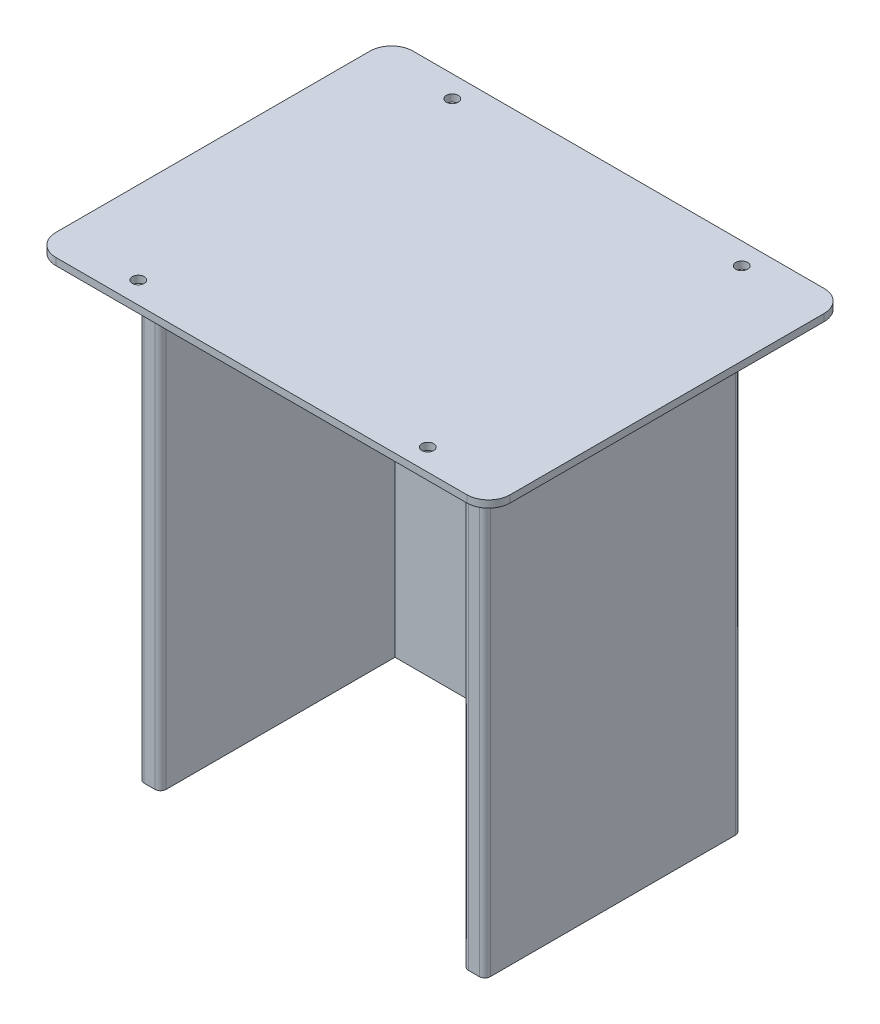
ISO-10303-21;
HEADER;
FILE_DESCRIPTION(('STEP AP214'),'2;1');
FILE_NAME('part.step','',(''),(''),'','','');
FILE_SCHEMA(('AUTOMOTIVE_DESIGN { 1 0 10303 214 1 1 1 1 }'));
ENDSEC;
DATA;
#1=APPLICATION_CONTEXT('core data for automotive mechanical design processes');
#2=APPLICATION_PROTOCOL_DEFINITION('international standard','automotive_design',2000,#1);
#3=PRODUCT_CONTEXT('',#1,'mechanical');
#4=PRODUCT('Part','Part','',(#3));
#5=PRODUCT_RELATED_PRODUCT_CATEGORY('part','',(#4));
#6=PRODUCT_DEFINITION_FORMATION('','',#4);
#7=PRODUCT_DEFINITION_CONTEXT('part definition',#1,'design');
#8=PRODUCT_DEFINITION('design','',#6,#7);
#9=PRODUCT_DEFINITION_SHAPE('','',#8);
#10=(LENGTH_UNIT() NAMED_UNIT(*) SI_UNIT(.MILLI.,.METRE.));
#11=(NAMED_UNIT(*) PLANE_ANGLE_UNIT() SI_UNIT($,.RADIAN.));
#12=(NAMED_UNIT(*) SI_UNIT($,.STERADIAN.) SOLID_ANGLE_UNIT());
#13=UNCERTAINTY_MEASURE_WITH_UNIT(LENGTH_MEASURE(1.E-05),#10,'distance_accuracy_value','');
#14=(GEOMETRIC_REPRESENTATION_CONTEXT(3) GLOBAL_UNCERTAINTY_ASSIGNED_CONTEXT((#13)) GLOBAL_UNIT_ASSIGNED_CONTEXT((#10,
#11,#12)) REPRESENTATION_CONTEXT('',''));
#15=CARTESIAN_POINT('',(0.,0.,0.));
#16=DIRECTION('',(0.,0.,1.));
#17=DIRECTION('',(1.,0.,0.));
#18=AXIS2_PLACEMENT_3D('',#15,#16,#17);
#19=CARTESIAN_POINT('',(110.010199778,3.302,82.55));
#20=DIRECTION('',(-1.,0.,0.));
#21=DIRECTION('',(0.,0.,1.));
#22=AXIS2_PLACEMENT_3D('',#19,#20,#21);
#23=PLANE('',#22);
#24=DIRECTION('',(0.,0.,-1.));
#25=VECTOR('',#24,1.);
#26=CARTESIAN_POINT('',(110.010199778,0.,82.55));
#27=LINE('',#26,#25);
#28=CARTESIAN_POINT('',(110.010199778,0.,72.55));
#29=VERTEX_POINT('',#28);
#30=CARTESIAN_POINT('',(110.010199778,0.,-72.55));
#31=VERTEX_POINT('',#30);
#32=EDGE_CURVE('E351',#29,#31,#27,.T.);
#33=ORIENTED_EDGE('',*,*,#32,.T.);
#34=DIRECTION('',(0.,-1.,0.));
#35=VECTOR('',#34,1.);
#36=CARTESIAN_POINT('',(110.010199778,3.302,-72.55));
#37=LINE('',#36,#35);
#38=CARTESIAN_POINT('',(110.010199778,3.302,-72.55));
#39=VERTEX_POINT('',#38);
#40=EDGE_CURVE('E425',#31,#39,#37,.F.);
#41=ORIENTED_EDGE('',*,*,#40,.T.);
#42=DIRECTION('',(0.,0.,-1.));
#43=VECTOR('',#42,1.);
#44=CARTESIAN_POINT('',(110.010199778,3.302,82.55));
#45=LINE('',#44,#43);
#46=CARTESIAN_POINT('',(110.010199778,3.302,72.55));
#47=VERTEX_POINT('',#46);
#48=EDGE_CURVE('E352',#47,#39,#45,.T.);
#49=ORIENTED_EDGE('',*,*,#48,.F.);
#50=DIRECTION('',(0.,-1.,0.));
#51=VECTOR('',#50,1.);
#52=CARTESIAN_POINT('',(110.010199778,3.302,72.55));
#53=LINE('',#52,#51);
#54=EDGE_CURVE('E421',#47,#29,#53,.T.);
#55=ORIENTED_EDGE('',*,*,#54,.T.);
#56=EDGE_LOOP('',(#33,#41,#49,#55));
#57=FACE_BOUND('',#56,.T.);
#58=ADVANCED_FACE('F41',(#57),#23,.F.);
#59=CARTESIAN_POINT('',(-99.934402,3.302,-82.55));
#60=DIRECTION('',(0.,0.,1.));
#61=DIRECTION('',(1.,0.,0.));
#62=AXIS2_PLACEMENT_3D('',#59,#60,#61);
#63=PLANE('',#62);
#64=DIRECTION('',(-1.,0.,0.));
#65=VECTOR('',#64,1.);
#66=CARTESIAN_POINT('',(-99.934402,0.,-82.55));
#67=LINE('',#66,#65);
#68=CARTESIAN_POINT('',(100.010199778,0.,-82.55));
#69=VERTEX_POINT('',#68);
#70=CARTESIAN_POINT('',(-89.934402,0.,-82.55));
#71=VERTEX_POINT('',#70);
#72=EDGE_CURVE('E373',#69,#71,#67,.T.);
#73=ORIENTED_EDGE('',*,*,#72,.T.);
#74=DIRECTION('',(0.,-1.,0.));
#75=VECTOR('',#74,1.);
#76=CARTESIAN_POINT('',(-89.934402,3.302,-82.55));
#77=LINE('',#76,#75);
#78=CARTESIAN_POINT('',(-89.934402,3.302,-82.55));
#79=VERTEX_POINT('',#78);
#80=EDGE_CURVE('E406',#71,#79,#77,.F.);
#81=ORIENTED_EDGE('',*,*,#80,.T.);
#82=DIRECTION('',(-1.,0.,0.));
#83=VECTOR('',#82,1.);
#84=CARTESIAN_POINT('',(-99.934402,3.302,-82.55));
#85=LINE('',#84,#83);
#86=CARTESIAN_POINT('',(100.010199778,3.302,-82.55));
#87=VERTEX_POINT('',#86);
#88=EDGE_CURVE('E356',#87,#79,#85,.T.);
#89=ORIENTED_EDGE('',*,*,#88,.F.);
#90=DIRECTION('',(0.,-1.,0.));
#91=VECTOR('',#90,1.);
#92=CARTESIAN_POINT('',(100.010199778,3.302,-82.55));
#93=LINE('',#92,#91);
#94=EDGE_CURVE('E402',#87,#69,#93,.T.);
#95=ORIENTED_EDGE('',*,*,#94,.T.);
#96=EDGE_LOOP('',(#73,#81,#89,#95));
#97=FACE_BOUND('',#96,.T.);
#98=ADVANCED_FACE('F585',(#97),#63,.F.);
#99=CARTESIAN_POINT('',(-99.934402,3.302,82.55));
#100=DIRECTION('',(1.,0.,0.));
#101=DIRECTION('',(0.,0.,-1.));
#102=AXIS2_PLACEMENT_3D('',#99,#100,#101);
#103=PLANE('',#102);
#104=DIRECTION('',(0.,0.,1.));
#105=VECTOR('',#104,1.);
#106=CARTESIAN_POINT('',(-99.934402,3.302,82.55));
#107=LINE('',#106,#105);
#108=CARTESIAN_POINT('',(-99.934402,3.302,-72.55));
#109=VERTEX_POINT('',#108);
#110=CARTESIAN_POINT('',(-99.934402,3.302,72.55));
#111=VERTEX_POINT('',#110);
#112=EDGE_CURVE('E361',#109,#111,#107,.T.);
#113=ORIENTED_EDGE('',*,*,#112,.F.);
#114=DIRECTION('',(0.,-1.,0.));
#115=VECTOR('',#114,1.);
#116=CARTESIAN_POINT('',(-99.934402,3.302,-72.55));
#117=LINE('',#116,#115);
#118=CARTESIAN_POINT('',(-99.934402,0.,-72.55));
#119=VERTEX_POINT('',#118);
#120=EDGE_CURVE('E386',#109,#119,#117,.T.);
#121=ORIENTED_EDGE('',*,*,#120,.T.);
#122=DIRECTION('',(0.,0.,1.));
#123=VECTOR('',#122,1.);
#124=CARTESIAN_POINT('',(-99.934402,0.,82.55));
#125=LINE('',#124,#123);
#126=CARTESIAN_POINT('',(-99.934402,0.,72.55));
#127=VERTEX_POINT('',#126);
#128=EDGE_CURVE('E377',#119,#127,#125,.T.);
#129=ORIENTED_EDGE('',*,*,#128,.T.);
#130=DIRECTION('',(0.,-1.,0.));
#131=VECTOR('',#130,1.);
#132=CARTESIAN_POINT('',(-99.934402,3.302,72.55));
#133=LINE('',#132,#131);
#134=EDGE_CURVE('E369',#127,#111,#133,.F.);
#135=ORIENTED_EDGE('',*,*,#134,.T.);
#136=EDGE_LOOP('',(#113,#121,#129,#135));
#137=FACE_BOUND('',#136,.T.);
#138=ADVANCED_FACE('F591',(#137),#103,.F.);
#139=CARTESIAN_POINT('',(-99.934402,3.302,82.55));
#140=DIRECTION('',(0.,0.,-1.));
#141=DIRECTION('',(-1.,0.,0.));
#142=AXIS2_PLACEMENT_3D('',#139,#140,#141);
#143=PLANE('',#142);
#144=DIRECTION('',(1.,0.,0.));
#145=VECTOR('',#144,1.);
#146=CARTESIAN_POINT('',(-99.934402,0.,82.55));
#147=LINE('',#146,#145);
#148=CARTESIAN_POINT('',(-89.934402,0.,82.55));
#149=VERTEX_POINT('',#148);
#150=CARTESIAN_POINT('',(100.010199778,0.,82.55));
#151=VERTEX_POINT('',#150);
#152=EDGE_CURVE('E357',#149,#151,#147,.T.);
#153=ORIENTED_EDGE('',*,*,#152,.T.);
#154=DIRECTION('',(0.,-1.,0.));
#155=VECTOR('',#154,1.);
#156=CARTESIAN_POINT('',(100.010199778,3.302,82.55));
#157=LINE('',#156,#155);
#158=CARTESIAN_POINT('',(100.010199778,3.302,82.55));
#159=VERTEX_POINT('',#158);
#160=EDGE_CURVE('E432',#151,#159,#157,.F.);
#161=ORIENTED_EDGE('',*,*,#160,.T.);
#162=DIRECTION('',(1.,0.,0.));
#163=VECTOR('',#162,1.);
#164=CARTESIAN_POINT('',(-99.934402,3.302,82.55));
#165=LINE('',#164,#163);
#166=CARTESIAN_POINT('',(-89.934402,3.302,82.55));
#167=VERTEX_POINT('',#166);
#168=EDGE_CURVE('E365',#167,#159,#165,.T.);
#169=ORIENTED_EDGE('',*,*,#168,.F.);
#170=DIRECTION('',(0.,-1.,0.));
#171=VECTOR('',#170,1.);
#172=CARTESIAN_POINT('',(-89.934402,3.302,82.55));
#173=LINE('',#172,#171);
#174=EDGE_CURVE('E428',#167,#149,#173,.T.);
#175=ORIENTED_EDGE('',*,*,#174,.T.);
#176=EDGE_LOOP('',(#153,#161,#169,#175));
#177=FACE_BOUND('',#176,.T.);
#178=ADVANCED_FACE('F853',(#177),#143,.F.);
#179=CARTESIAN_POINT('',(0.,3.302,0.));
#180=DIRECTION('',(0.,-1.,0.));
#181=DIRECTION('',(0.,0.,-1.));
#182=AXIS2_PLACEMENT_3D('',#179,#180,#181);
#183=PLANE('',#182);
#184=CARTESIAN_POINT('',(71.910199778,3.302,72.55));
#185=DIRECTION('',(0.,1.,0.));
#186=DIRECTION('',(0.,0.,1.));
#187=AXIS2_PLACEMENT_3D('',#184,#185,#186);
#188=CIRCLE('',#187,2.74999999999999);
#189=CARTESIAN_POINT('',(71.910199778,3.302,75.3));
#190=VERTEX_POINT('',#189);
#191=EDGE_CURVE('E319',#190,#190,#188,.T.);
#192=ORIENTED_EDGE('',*,*,#191,.F.);
#193=EDGE_LOOP('',(#192));
#194=FACE_BOUND('',#193,.T.);
#195=CARTESIAN_POINT('',(-61.834402,3.302,72.55));
#196=DIRECTION('',(0.,1.,0.));
#197=DIRECTION('',(0.,0.,1.));
#198=AXIS2_PLACEMENT_3D('',#195,#196,#197);
#199=CIRCLE('',#198,2.74999999999999);
#200=CARTESIAN_POINT('',(-61.834402,3.302,75.3));
#201=VERTEX_POINT('',#200);
#202=EDGE_CURVE('E327',#201,#201,#199,.T.);
#203=ORIENTED_EDGE('',*,*,#202,.F.);
#204=EDGE_LOOP('',(#203));
#205=FACE_BOUND('',#204,.T.);
#206=CARTESIAN_POINT('',(71.910199778,3.302,-72.55));
#207=DIRECTION('',(0.,1.,0.));
#208=DIRECTION('',(0.,0.,1.));
#209=AXIS2_PLACEMENT_3D('',#206,#207,#208);
#210=CIRCLE('',#209,2.74999999999999);
#211=CARTESIAN_POINT('',(71.910199778,3.302,-69.8));
#212=VERTEX_POINT('',#211);
#213=EDGE_CURVE('E335',#212,#212,#210,.T.);
#214=ORIENTED_EDGE('',*,*,#213,.F.);
#215=EDGE_LOOP('',(#214));
#216=FACE_BOUND('',#215,.T.);
#217=CARTESIAN_POINT('',(-61.834402,3.302,-72.55));
#218=DIRECTION('',(0.,1.,0.));
#219=DIRECTION('',(0.,0.,1.));
#220=AXIS2_PLACEMENT_3D('',#217,#218,#219);
#221=CIRCLE('',#220,2.74999999999999);
#222=CARTESIAN_POINT('',(-61.834402,3.302,-69.8));
#223=VERTEX_POINT('',#222);
#224=EDGE_CURVE('E343',#223,#223,#221,.T.);
#225=ORIENTED_EDGE('',*,*,#224,.F.);
#226=EDGE_LOOP('',(#225));
#227=FACE_BOUND('',#226,.T.);
#228=ORIENTED_EDGE('',*,*,#88,.T.);
#229=CARTESIAN_POINT('',(-89.934402,3.302,-72.55));
#230=DIRECTION('',(0.,-1.,0.));
#231=DIRECTION('',(0.,0.,-1.));
#232=AXIS2_PLACEMENT_3D('',#229,#230,#231);
#233=CIRCLE('',#232,10.);
#234=EDGE_CURVE('E418',#79,#109,#233,.F.);
#235=ORIENTED_EDGE('',*,*,#234,.T.);
#236=ORIENTED_EDGE('',*,*,#112,.T.);
#237=CARTESIAN_POINT('',(-89.934402,3.302,72.55));
#238=DIRECTION('',(0.,-1.,0.));
#239=DIRECTION('',(0.,0.,-1.));
#240=AXIS2_PLACEMENT_3D('',#237,#238,#239);
#241=CIRCLE('',#240,10.);
#242=EDGE_CURVE('E409',#111,#167,#241,.F.);
#243=ORIENTED_EDGE('',*,*,#242,.T.);
#244=ORIENTED_EDGE('',*,*,#168,.T.);
#245=CARTESIAN_POINT('',(100.010199778,3.302,72.55));
#246=DIRECTION('',(0.,-1.,0.));
#247=DIRECTION('',(0.,0.,-1.));
#248=AXIS2_PLACEMENT_3D('',#245,#246,#247);
#249=CIRCLE('',#248,10.);
#250=EDGE_CURVE('E412',#159,#47,#249,.F.);
#251=ORIENTED_EDGE('',*,*,#250,.T.);
#252=ORIENTED_EDGE('',*,*,#48,.T.);
#253=CARTESIAN_POINT('',(100.010199778,3.302,-72.55));
#254=DIRECTION('',(0.,-1.,0.));
#255=DIRECTION('',(0.,0.,-1.));
#256=AXIS2_PLACEMENT_3D('',#253,#254,#255);
#257=CIRCLE('',#256,10.);
#258=EDGE_CURVE('E415',#39,#87,#257,.F.);
#259=ORIENTED_EDGE('',*,*,#258,.T.);
#260=EDGE_LOOP('',(#228,#235,#236,#243,#244,#251,#252,#259));
#261=FACE_BOUND('',#260,.T.);
#262=ADVANCED_FACE('F703',(#194,#205,#216,#227,#261),#183,.F.);
#263=CARTESIAN_POINT('',(0.,0.,0.));
#264=DIRECTION('',(0.,-1.,0.));
#265=DIRECTION('',(0.,0.,-1.));
#266=AXIS2_PLACEMENT_3D('',#263,#264,#265);
#267=PLANE('',#266);
#268=DIRECTION('',(0.,0.,-1.));
#269=VECTOR('',#268,1.);
#270=CARTESIAN_POINT('',(85.0051000000002,0.,0.));
#271=LINE('',#270,#269);
#272=CARTESIAN_POINT('',(85.0051000000001,0.,56.71));
#273=VERTEX_POINT('',#272);
#274=CARTESIAN_POINT('',(85.0051000000002,0.,-56.5978));
#275=VERTEX_POINT('',#274);
#276=EDGE_CURVE('E304',#273,#275,#271,.T.);
#277=ORIENTED_EDGE('',*,*,#276,.T.);
#278=CARTESIAN_POINT('',(82.4651000000002,0.,-56.5978));
#279=DIRECTION('',(0.,-1.,0.));
#280=DIRECTION('',(0.,0.,-1.));
#281=AXIS2_PLACEMENT_3D('',#278,#279,#280);
#282=CIRCLE('',#281,2.54);
#283=CARTESIAN_POINT('',(82.4651000000002,0.,-59.1378));
#284=VERTEX_POINT('',#283);
#285=EDGE_CURVE('E494',#275,#284,#282,.F.);
#286=ORIENTED_EDGE('',*,*,#285,.T.);
#287=DIRECTION('',(-1.,0.,0.));
#288=VECTOR('',#287,1.);
#289=CARTESIAN_POINT('',(85.0051000000001,0.,-59.1378));
#290=LINE('',#289,#288);
#291=CARTESIAN_POINT('',(-72.4650999999998,0.,-59.1378));
#292=VERTEX_POINT('',#291);
#293=EDGE_CURVE('E225',#284,#292,#290,.T.);
#294=ORIENTED_EDGE('',*,*,#293,.T.);
#295=CARTESIAN_POINT('',(-72.4650999999998,0.,-56.5978));
#296=DIRECTION('',(0.,-1.,0.));
#297=DIRECTION('',(0.,0.,-1.));
#298=AXIS2_PLACEMENT_3D('',#295,#296,#297);
#299=CIRCLE('',#298,2.54);
#300=CARTESIAN_POINT('',(-75.0050999999998,0.,-56.5978));
#301=VERTEX_POINT('',#300);
#302=EDGE_CURVE('E497',#292,#301,#299,.F.);
#303=ORIENTED_EDGE('',*,*,#302,.T.);
#304=DIRECTION('',(0.,0.,-1.));
#305=VECTOR('',#304,1.);
#306=CARTESIAN_POINT('',(-75.0050999999998,0.,0.));
#307=LINE('',#306,#305);
#308=CARTESIAN_POINT('',(-75.0050999999998,0.,56.71));
#309=VERTEX_POINT('',#308);
#310=EDGE_CURVE('E305',#309,#301,#307,.T.);
#311=ORIENTED_EDGE('',*,*,#310,.F.);
#312=CARTESIAN_POINT('',(-72.4650999999998,0.,56.71));
#313=DIRECTION('',(0.,-1.,0.));
#314=DIRECTION('',(0.,0.,-1.));
#315=AXIS2_PLACEMENT_3D('',#312,#313,#314);
#316=CIRCLE('',#315,2.54);
#317=CARTESIAN_POINT('',(-72.4650999999998,0.,59.25));
#318=VERTEX_POINT('',#317);
#319=EDGE_CURVE('E500',#309,#318,#316,.F.);
#320=ORIENTED_EDGE('',*,*,#319,.T.);
#321=DIRECTION('',(-1.,0.,0.));
#322=VECTOR('',#321,1.);
#323=CARTESIAN_POINT('',(0.,0.,59.25));
#324=LINE('',#323,#322);
#325=CARTESIAN_POINT('',(-67.3850999999999,0.,59.25));
#326=VERTEX_POINT('',#325);
#327=EDGE_CURVE('E300',#326,#318,#324,.T.);
#328=ORIENTED_EDGE('',*,*,#327,.F.);
#329=CARTESIAN_POINT('',(-67.3850999999999,0.,56.71));
#330=DIRECTION('',(0.,-1.,0.));
#331=DIRECTION('',(0.,0.,-1.));
#332=AXIS2_PLACEMENT_3D('',#329,#330,#331);
#333=CIRCLE('',#332,2.54);
#334=CARTESIAN_POINT('',(-64.8450999999998,0.,56.71));
#335=VERTEX_POINT('',#334);
#336=EDGE_CURVE('E11',#326,#335,#333,.F.);
#337=ORIENTED_EDGE('',*,*,#336,.T.);
#338=DIRECTION('',(0.,0.,-1.));
#339=VECTOR('',#338,1.);
#340=CARTESIAN_POINT('',(-64.8450999999998,0.,0.));
#341=LINE('',#340,#339);
#342=CARTESIAN_POINT('',(-64.8450999999998,0.,-49.09));
#343=VERTEX_POINT('',#342);
#344=EDGE_CURVE('E297',#335,#343,#341,.T.);
#345=ORIENTED_EDGE('',*,*,#344,.T.);
#346=DIRECTION('',(1.,0.,0.));
#347=VECTOR('',#346,1.);
#348=CARTESIAN_POINT('',(0.,0.,-49.09));
#349=LINE('',#348,#347);
#350=CARTESIAN_POINT('',(74.9209000000002,0.,-49.09));
#351=VERTEX_POINT('',#350);
#352=EDGE_CURVE('E293',#343,#351,#349,.T.);
#353=ORIENTED_EDGE('',*,*,#352,.T.);
#354=DIRECTION('',(0.,0.,1.));
#355=VECTOR('',#354,1.);
#356=CARTESIAN_POINT('',(74.9209000000002,0.,0.));
#357=LINE('',#356,#355);
#358=CARTESIAN_POINT('',(74.9209000000002,0.,56.71));
#359=VERTEX_POINT('',#358);
#360=EDGE_CURVE('E264',#351,#359,#357,.T.);
#361=ORIENTED_EDGE('',*,*,#360,.T.);
#362=CARTESIAN_POINT('',(77.4609000000002,0.,56.71));
#363=DIRECTION('',(0.,-1.,0.));
#364=DIRECTION('',(0.,0.,-1.));
#365=AXIS2_PLACEMENT_3D('',#362,#363,#364);
#366=CIRCLE('',#365,2.54);
#367=CARTESIAN_POINT('',(77.4609000000002,0.,59.25));
#368=VERTEX_POINT('',#367);
#369=EDGE_CURVE('E50',#359,#368,#366,.F.);
#370=ORIENTED_EDGE('',*,*,#369,.T.);
#371=CARTESIAN_POINT('',(82.4651000000001,0.,59.25));
#372=VERTEX_POINT('',#371);
#373=EDGE_CURVE('E270',#372,#368,#324,.T.);
#374=ORIENTED_EDGE('',*,*,#373,.F.);
#375=CARTESIAN_POINT('',(82.4651000000001,0.,56.71));
#376=DIRECTION('',(0.,-1.,0.));
#377=DIRECTION('',(0.,0.,-1.));
#378=AXIS2_PLACEMENT_3D('',#375,#376,#377);
#379=CIRCLE('',#378,2.54);
#380=EDGE_CURVE('E503',#372,#273,#379,.F.);
#381=ORIENTED_EDGE('',*,*,#380,.T.);
#382=EDGE_LOOP('',(#277,#286,#294,#303,#311,#320,#328,#337,#345,#353,#361,#370,#374,#381));
#383=FACE_BOUND('',#382,.T.);
#384=CARTESIAN_POINT('',(71.910199778,0.,72.55));
#385=DIRECTION('',(0.,-1.,0.));
#386=DIRECTION('',(0.,0.,-1.));
#387=AXIS2_PLACEMENT_3D('',#384,#385,#386);
#388=CIRCLE('',#387,2.75);
#389=CARTESIAN_POINT('',(71.910199778,0.,69.8));
#390=VERTEX_POINT('',#389);
#391=EDGE_CURVE('E323',#390,#390,#388,.T.);
#392=ORIENTED_EDGE('',*,*,#391,.F.);
#393=EDGE_LOOP('',(#392));
#394=FACE_BOUND('',#393,.T.);
#395=CARTESIAN_POINT('',(-61.834402,0.,72.55));
#396=DIRECTION('',(0.,-1.,0.));
#397=DIRECTION('',(0.,0.,-1.));
#398=AXIS2_PLACEMENT_3D('',#395,#396,#397);
#399=CIRCLE('',#398,2.74999999999999);
#400=CARTESIAN_POINT('',(-61.834402,0.,69.8));
#401=VERTEX_POINT('',#400);
#402=EDGE_CURVE('E331',#401,#401,#399,.T.);
#403=ORIENTED_EDGE('',*,*,#402,.F.);
#404=EDGE_LOOP('',(#403));
#405=FACE_BOUND('',#404,.T.);
#406=CARTESIAN_POINT('',(71.910199778,0.,-72.55));
#407=DIRECTION('',(0.,-1.,0.));
#408=DIRECTION('',(0.,0.,-1.));
#409=AXIS2_PLACEMENT_3D('',#406,#407,#408);
#410=CIRCLE('',#409,2.75);
#411=CARTESIAN_POINT('',(71.910199778,0.,-75.3));
#412=VERTEX_POINT('',#411);
#413=EDGE_CURVE('E339',#412,#412,#410,.T.);
#414=ORIENTED_EDGE('',*,*,#413,.F.);
#415=EDGE_LOOP('',(#414));
#416=FACE_BOUND('',#415,.T.);
#417=CARTESIAN_POINT('',(-61.834402,0.,-72.55));
#418=DIRECTION('',(0.,-1.,0.));
#419=DIRECTION('',(0.,0.,-1.));
#420=AXIS2_PLACEMENT_3D('',#417,#418,#419);
#421=CIRCLE('',#420,2.74999999999999);
#422=CARTESIAN_POINT('',(-61.834402,0.,-75.3));
#423=VERTEX_POINT('',#422);
#424=EDGE_CURVE('E347',#423,#423,#421,.T.);
#425=ORIENTED_EDGE('',*,*,#424,.F.);
#426=EDGE_LOOP('',(#425));
#427=FACE_BOUND('',#426,.T.);
#428=ORIENTED_EDGE('',*,*,#128,.F.);
#429=CARTESIAN_POINT('',(-89.934402,0.,-72.55));
#430=DIRECTION('',(0.,-1.,0.));
#431=DIRECTION('',(0.,0.,-1.));
#432=AXIS2_PLACEMENT_3D('',#429,#430,#431);
#433=CIRCLE('',#432,10.);
#434=EDGE_CURVE('E399',#119,#71,#433,.T.);
#435=ORIENTED_EDGE('',*,*,#434,.T.);
#436=ORIENTED_EDGE('',*,*,#72,.F.);
#437=CARTESIAN_POINT('',(100.010199778,0.,-72.55));
#438=DIRECTION('',(0.,-1.,0.));
#439=DIRECTION('',(0.,0.,-1.));
#440=AXIS2_PLACEMENT_3D('',#437,#438,#439);
#441=CIRCLE('',#440,10.);
#442=EDGE_CURVE('E396',#69,#31,#441,.T.);
#443=ORIENTED_EDGE('',*,*,#442,.T.);
#444=ORIENTED_EDGE('',*,*,#32,.F.);
#445=CARTESIAN_POINT('',(100.010199778,0.,72.55));
#446=DIRECTION('',(0.,-1.,0.));
#447=DIRECTION('',(0.,0.,-1.));
#448=AXIS2_PLACEMENT_3D('',#445,#446,#447);
#449=CIRCLE('',#448,10.);
#450=EDGE_CURVE('E393',#29,#151,#449,.T.);
#451=ORIENTED_EDGE('',*,*,#450,.T.);
#452=ORIENTED_EDGE('',*,*,#152,.F.);
#453=CARTESIAN_POINT('',(-89.934402,0.,72.55));
#454=DIRECTION('',(0.,-1.,0.));
#455=DIRECTION('',(0.,0.,-1.));
#456=AXIS2_PLACEMENT_3D('',#453,#454,#455);
#457=CIRCLE('',#456,10.);
#458=EDGE_CURVE('E390',#149,#127,#457,.T.);
#459=ORIENTED_EDGE('',*,*,#458,.T.);
#460=EDGE_LOOP('',(#428,#435,#436,#443,#444,#451,#452,#459));
#461=FACE_BOUND('',#460,.T.);
#462=ADVANCED_FACE('F507',(#383,#394,#405,#416,#427,#461),#267,.T.);
#463=CARTESIAN_POINT('',(-61.834402,3.302,-72.55));
#464=DIRECTION('',(0.,1.,0.));
#465=DIRECTION('',(0.,0.,1.));
#466=AXIS2_PLACEMENT_3D('',#463,#464,#465);
#467=CYLINDRICAL_SURFACE('',#466,2.74999999999999);
#468=ORIENTED_EDGE('',*,*,#224,.T.);
#469=EDGE_LOOP('',(#468));
#470=FACE_BOUND('',#469,.T.);
#471=ORIENTED_EDGE('',*,*,#424,.T.);
#472=EDGE_LOOP('',(#471));
#473=FACE_BOUND('',#472,.T.);
#474=ADVANCED_FACE('F702',(#470,#473),#467,.F.);
#475=CARTESIAN_POINT('',(71.910199778,3.302,-72.55));
#476=DIRECTION('',(0.,1.,0.));
#477=DIRECTION('',(0.,0.,1.));
#478=AXIS2_PLACEMENT_3D('',#475,#476,#477);
#479=CYLINDRICAL_SURFACE('',#478,2.75);
#480=ORIENTED_EDGE('',*,*,#213,.T.);
#481=EDGE_LOOP('',(#480));
#482=FACE_BOUND('',#481,.T.);
#483=ORIENTED_EDGE('',*,*,#413,.T.);
#484=EDGE_LOOP('',(#483));
#485=FACE_BOUND('',#484,.T.);
#486=ADVANCED_FACE('F898',(#482,#485),#479,.F.);
#487=CARTESIAN_POINT('',(-61.834402,3.302,72.55));
#488=DIRECTION('',(0.,1.,0.));
#489=DIRECTION('',(0.,0.,1.));
#490=AXIS2_PLACEMENT_3D('',#487,#488,#489);
#491=CYLINDRICAL_SURFACE('',#490,2.74999999999999);
#492=ORIENTED_EDGE('',*,*,#202,.T.);
#493=EDGE_LOOP('',(#492));
#494=FACE_BOUND('',#493,.T.);
#495=ORIENTED_EDGE('',*,*,#402,.T.);
#496=EDGE_LOOP('',(#495));
#497=FACE_BOUND('',#496,.T.);
#498=ADVANCED_FACE('F888',(#494,#497),#491,.F.);
#499=CARTESIAN_POINT('',(71.910199778,3.302,72.55));
#500=DIRECTION('',(0.,1.,0.));
#501=DIRECTION('',(0.,0.,1.));
#502=AXIS2_PLACEMENT_3D('',#499,#500,#501);
#503=CYLINDRICAL_SURFACE('',#502,2.75);
#504=ORIENTED_EDGE('',*,*,#191,.T.);
#505=EDGE_LOOP('',(#504));
#506=FACE_BOUND('',#505,.T.);
#507=ORIENTED_EDGE('',*,*,#391,.T.);
#508=EDGE_LOOP('',(#507));
#509=FACE_BOUND('',#508,.T.);
#510=ADVANCED_FACE('F600',(#506,#509),#503,.F.);
#511=CARTESIAN_POINT('',(-89.934402,3.302,-72.55));
#512=DIRECTION('',(0.,-1.,0.));
#513=DIRECTION('',(0.,0.,-1.));
#514=AXIS2_PLACEMENT_3D('',#511,#512,#513);
#515=CYLINDRICAL_SURFACE('',#514,10.);
#516=ORIENTED_EDGE('',*,*,#234,.F.);
#517=ORIENTED_EDGE('',*,*,#80,.F.);
#518=ORIENTED_EDGE('',*,*,#434,.F.);
#519=ORIENTED_EDGE('',*,*,#120,.F.);
#520=EDGE_LOOP('',(#516,#517,#518,#519));
#521=FACE_BOUND('',#520,.T.);
#522=ADVANCED_FACE('F596',(#521),#515,.T.);
#523=CARTESIAN_POINT('',(100.010199778,3.302,-72.55));
#524=DIRECTION('',(0.,-1.,0.));
#525=DIRECTION('',(0.,0.,-1.));
#526=AXIS2_PLACEMENT_3D('',#523,#524,#525);
#527=CYLINDRICAL_SURFACE('',#526,10.);
#528=ORIENTED_EDGE('',*,*,#258,.F.);
#529=ORIENTED_EDGE('',*,*,#40,.F.);
#530=ORIENTED_EDGE('',*,*,#442,.F.);
#531=ORIENTED_EDGE('',*,*,#94,.F.);
#532=EDGE_LOOP('',(#528,#529,#530,#531));
#533=FACE_BOUND('',#532,.T.);
#534=ADVANCED_FACE('F599',(#533),#527,.T.);
#535=CARTESIAN_POINT('',(100.010199778,3.302,72.55));
#536=DIRECTION('',(0.,-1.,0.));
#537=DIRECTION('',(0.,0.,-1.));
#538=AXIS2_PLACEMENT_3D('',#535,#536,#537);
#539=CYLINDRICAL_SURFACE('',#538,10.);
#540=ORIENTED_EDGE('',*,*,#250,.F.);
#541=ORIENTED_EDGE('',*,*,#160,.F.);
#542=ORIENTED_EDGE('',*,*,#450,.F.);
#543=ORIENTED_EDGE('',*,*,#54,.F.);
#544=EDGE_LOOP('',(#540,#541,#542,#543));
#545=FACE_BOUND('',#544,.T.);
#546=ADVANCED_FACE('F604',(#545),#539,.T.);
#547=CARTESIAN_POINT('',(-89.934402,3.302,72.55));
#548=DIRECTION('',(0.,-1.,0.));
#549=DIRECTION('',(0.,0.,-1.));
#550=AXIS2_PLACEMENT_3D('',#547,#548,#549);
#551=CYLINDRICAL_SURFACE('',#550,10.);
#552=ORIENTED_EDGE('',*,*,#242,.F.);
#553=ORIENTED_EDGE('',*,*,#134,.F.);
#554=ORIENTED_EDGE('',*,*,#458,.F.);
#555=ORIENTED_EDGE('',*,*,#174,.F.);
#556=EDGE_LOOP('',(#552,#553,#554,#555));
#557=FACE_BOUND('',#556,.T.);
#558=ADVANCED_FACE('F608',(#557),#551,.T.);
#559=CARTESIAN_POINT('',(74.9209000000002,-210.,0.));
#560=DIRECTION('',(-1.,0.,0.));
#561=DIRECTION('',(0.,0.,1.));
#562=AXIS2_PLACEMENT_3D('',#559,#560,#561);
#563=PLANE('',#562);
#564=DIRECTION('',(0.,0.,1.));
#565=VECTOR('',#564,1.);
#566=CARTESIAN_POINT('',(74.9209000000002,-210.,0.));
#567=LINE('',#566,#565);
#568=CARTESIAN_POINT('',(74.9209000000002,-210.,-49.09));
#569=VERTEX_POINT('',#568);
#570=CARTESIAN_POINT('',(74.9209000000002,-210.,56.71));
#571=VERTEX_POINT('',#570);
#572=EDGE_CURVE('E265',#569,#571,#567,.T.);
#573=ORIENTED_EDGE('',*,*,#572,.T.);
#574=DIRECTION('',(0.,1.,0.));
#575=VECTOR('',#574,1.);
#576=CARTESIAN_POINT('',(74.9209000000002,0.,56.71));
#577=LINE('',#576,#575);
#578=EDGE_CURVE('E488',#571,#359,#577,.T.);
#579=ORIENTED_EDGE('',*,*,#578,.T.);
#580=ORIENTED_EDGE('',*,*,#360,.F.);
#581=DIRECTION('',(0.,1.,0.));
#582=VECTOR('',#581,1.);
#583=CARTESIAN_POINT('',(74.9209000000002,-210.,-49.09));
#584=LINE('',#583,#582);
#585=EDGE_CURVE('E316',#569,#351,#584,.T.);
#586=ORIENTED_EDGE('',*,*,#585,.F.);
#587=EDGE_LOOP('',(#573,#579,#580,#586));
#588=FACE_BOUND('',#587,.T.);
#589=ADVANCED_FACE('F524',(#588),#563,.T.);
#590=CARTESIAN_POINT('',(0.,-210.,-49.09));
#591=DIRECTION('',(0.,0.,1.));
#592=DIRECTION('',(1.,0.,0.));
#593=AXIS2_PLACEMENT_3D('',#590,#591,#592);
#594=PLANE('',#593);
#595=ORIENTED_EDGE('',*,*,#352,.F.);
#596=DIRECTION('',(0.,1.,0.));
#597=VECTOR('',#596,1.);
#598=CARTESIAN_POINT('',(-64.8450999999998,-210.,-49.09));
#599=LINE('',#598,#597);
#600=CARTESIAN_POINT('',(-64.8450999999998,-210.,-49.09));
#601=VERTEX_POINT('',#600);
#602=EDGE_CURVE('E312',#601,#343,#599,.T.);
#603=ORIENTED_EDGE('',*,*,#602,.F.);
#604=DIRECTION('',(1.,0.,0.));
#605=VECTOR('',#604,1.);
#606=CARTESIAN_POINT('',(0.,-210.,-49.09));
#607=LINE('',#606,#605);
#608=EDGE_CURVE('E269',#601,#569,#607,.T.);
#609=ORIENTED_EDGE('',*,*,#608,.T.);
#610=ORIENTED_EDGE('',*,*,#585,.T.);
#611=EDGE_LOOP('',(#595,#603,#609,#610));
#612=FACE_BOUND('',#611,.T.);
#613=ADVANCED_FACE('F527',(#612),#594,.T.);
#614=CARTESIAN_POINT('',(-64.8450999999998,-210.,0.));
#615=DIRECTION('',(1.,0.,0.));
#616=DIRECTION('',(0.,0.,-1.));
#617=AXIS2_PLACEMENT_3D('',#614,#615,#616);
#618=PLANE('',#617);
#619=ORIENTED_EDGE('',*,*,#344,.F.);
#620=DIRECTION('',(0.,1.,0.));
#621=VECTOR('',#620,1.);
#622=CARTESIAN_POINT('',(-64.8450999999998,-210.,56.71));
#623=LINE('',#622,#621);
#624=CARTESIAN_POINT('',(-64.8450999999998,-210.,56.71));
#625=VERTEX_POINT('',#624);
#626=EDGE_CURVE('E491',#335,#625,#623,.F.);
#627=ORIENTED_EDGE('',*,*,#626,.T.);
#628=DIRECTION('',(0.,0.,-1.));
#629=VECTOR('',#628,1.);
#630=CARTESIAN_POINT('',(-64.8450999999998,-210.,0.));
#631=LINE('',#630,#629);
#632=EDGE_CURVE('E274',#625,#601,#631,.T.);
#633=ORIENTED_EDGE('',*,*,#632,.T.);
#634=ORIENTED_EDGE('',*,*,#602,.T.);
#635=EDGE_LOOP('',(#619,#627,#633,#634));
#636=FACE_BOUND('',#635,.T.);
#637=ADVANCED_FACE('F815',(#636),#618,.T.);
#638=CARTESIAN_POINT('',(0.,-210.,59.25));
#639=DIRECTION('',(0.,0.,-1.));
#640=DIRECTION('',(-1.,0.,0.));
#641=AXIS2_PLACEMENT_3D('',#638,#639,#640);
#642=PLANE('',#641);
#643=ORIENTED_EDGE('',*,*,#327,.T.);
#644=DIRECTION('',(0.,1.,0.));
#645=VECTOR('',#644,1.);
#646=CARTESIAN_POINT('',(-72.4650999999998,-210.,59.25));
#647=LINE('',#646,#645);
#648=CARTESIAN_POINT('',(-72.4650999999998,-210.,59.25));
#649=VERTEX_POINT('',#648);
#650=EDGE_CURVE('E478',#318,#649,#647,.F.);
#651=ORIENTED_EDGE('',*,*,#650,.T.);
#652=DIRECTION('',(-1.,0.,0.));
#653=VECTOR('',#652,1.);
#654=CARTESIAN_POINT('',(0.,-210.,59.25));
#655=LINE('',#654,#653);
#656=CARTESIAN_POINT('',(-67.3850999999999,-210.,59.25));
#657=VERTEX_POINT('',#656);
#658=EDGE_CURVE('E277',#657,#649,#655,.T.);
#659=ORIENTED_EDGE('',*,*,#658,.F.);
#660=DIRECTION('',(0.,1.,0.));
#661=VECTOR('',#660,1.);
#662=CARTESIAN_POINT('',(-67.3850999999999,0.,59.25));
#663=LINE('',#662,#661);
#664=EDGE_CURVE('E474',#657,#326,#663,.T.);
#665=ORIENTED_EDGE('',*,*,#664,.T.);
#666=EDGE_LOOP('',(#643,#651,#659,#665));
#667=FACE_BOUND('',#666,.T.);
#668=ADVANCED_FACE('F538',(#667),#642,.F.);
#669=CARTESIAN_POINT('',(-75.0050999999998,-210.,0.));
#670=DIRECTION('',(1.,0.,0.));
#671=DIRECTION('',(0.,0.,-1.));
#672=AXIS2_PLACEMENT_3D('',#669,#670,#671);
#673=PLANE('',#672);
#674=ORIENTED_EDGE('',*,*,#310,.T.);
#675=DIRECTION('',(0.,-1.,0.));
#676=VECTOR('',#675,1.);
#677=CARTESIAN_POINT('',(-75.0050999999998,-210.,-56.5978));
#678=LINE('',#677,#676);
#679=CARTESIAN_POINT('',(-75.0050999999998,-210.,-56.5978));
#680=VERTEX_POINT('',#679);
#681=EDGE_CURVE('E470',#301,#680,#678,.T.);
#682=ORIENTED_EDGE('',*,*,#681,.T.);
#683=DIRECTION('',(0.,0.,-1.));
#684=VECTOR('',#683,1.);
#685=CARTESIAN_POINT('',(-75.0050999999998,-210.,0.));
#686=LINE('',#685,#684);
#687=CARTESIAN_POINT('',(-75.0050999999998,-210.,56.71));
#688=VERTEX_POINT('',#687);
#689=EDGE_CURVE('E281',#688,#680,#686,.T.);
#690=ORIENTED_EDGE('',*,*,#689,.F.);
#691=DIRECTION('',(0.,1.,0.));
#692=VECTOR('',#691,1.);
#693=CARTESIAN_POINT('',(-75.0050999999998,-210.,56.71));
#694=LINE('',#693,#692);
#695=EDGE_CURVE('E466',#688,#309,#694,.T.);
#696=ORIENTED_EDGE('',*,*,#695,.T.);
#697=EDGE_LOOP('',(#674,#682,#690,#696));
#698=FACE_BOUND('',#697,.T.);
#699=ADVANCED_FACE('F549',(#698),#673,.F.);
#700=CARTESIAN_POINT('',(85.0051000000002,-210.,0.));
#701=DIRECTION('',(1.,0.,0.));
#702=DIRECTION('',(0.,0.,-1.));
#703=AXIS2_PLACEMENT_3D('',#700,#701,#702);
#704=PLANE('',#703);
#705=DIRECTION('',(0.,0.,-1.));
#706=VECTOR('',#705,1.);
#707=CARTESIAN_POINT('',(85.0051000000002,-210.,0.));
#708=LINE('',#707,#706);
#709=CARTESIAN_POINT('',(85.0051000000001,-210.,56.71));
#710=VERTEX_POINT('',#709);
#711=CARTESIAN_POINT('',(85.0051000000002,-210.,-56.5978));
#712=VERTEX_POINT('',#711);
#713=EDGE_CURVE('E286',#710,#712,#708,.T.);
#714=ORIENTED_EDGE('',*,*,#713,.T.);
#715=DIRECTION('',(0.,-1.,0.));
#716=VECTOR('',#715,1.);
#717=CARTESIAN_POINT('',(85.0051000000002,-210.,-56.5978));
#718=LINE('',#717,#716);
#719=EDGE_CURVE('E463',#712,#275,#718,.F.);
#720=ORIENTED_EDGE('',*,*,#719,.T.);
#721=ORIENTED_EDGE('',*,*,#276,.F.);
#722=DIRECTION('',(0.,1.,0.));
#723=VECTOR('',#722,1.);
#724=CARTESIAN_POINT('',(85.0051000000001,-210.,56.71));
#725=LINE('',#724,#723);
#726=EDGE_CURVE('E460',#273,#710,#725,.F.);
#727=ORIENTED_EDGE('',*,*,#726,.T.);
#728=EDGE_LOOP('',(#714,#720,#721,#727));
#729=FACE_BOUND('',#728,.T.);
#730=ADVANCED_FACE('F572',(#729),#704,.T.);
#731=CARTESIAN_POINT('',(82.4651000000001,-210.,59.25));
#732=VERTEX_POINT('',#731);
#733=CARTESIAN_POINT('',(77.4609000000002,-210.,59.25));
#734=VERTEX_POINT('',#733);
#735=EDGE_CURVE('E282',#732,#734,#655,.T.);
#736=ORIENTED_EDGE('',*,*,#735,.F.);
#737=DIRECTION('',(0.,1.,0.));
#738=VECTOR('',#737,1.);
#739=CARTESIAN_POINT('',(82.4651000000001,0.,59.25));
#740=LINE('',#739,#738);
#741=EDGE_CURVE('E484',#732,#372,#740,.T.);
#742=ORIENTED_EDGE('',*,*,#741,.T.);
#743=ORIENTED_EDGE('',*,*,#373,.T.);
#744=DIRECTION('',(0.,1.,0.));
#745=VECTOR('',#744,1.);
#746=CARTESIAN_POINT('',(77.4609000000002,-210.,59.25));
#747=LINE('',#746,#745);
#748=EDGE_CURVE('E481',#368,#734,#747,.F.);
#749=ORIENTED_EDGE('',*,*,#748,.T.);
#750=EDGE_LOOP('',(#736,#742,#743,#749));
#751=FACE_BOUND('',#750,.T.);
#752=ADVANCED_FACE('F512',(#751),#642,.F.);
#753=CARTESIAN_POINT('',(0.,-210.,0.));
#754=DIRECTION('',(0.,-1.,0.));
#755=DIRECTION('',(0.,0.,-1.));
#756=AXIS2_PLACEMENT_3D('',#753,#754,#755);
#757=PLANE('',#756);
#758=DIRECTION('',(1.,0.,0.));
#759=VECTOR('',#758,1.);
#760=CARTESIAN_POINT('',(85.0051000000001,-210.,-59.1378));
#761=LINE('',#760,#759);
#762=CARTESIAN_POINT('',(-72.4650999999998,-210.,-59.1378));
#763=VERTEX_POINT('',#762);
#764=CARTESIAN_POINT('',(82.4651000000002,-210.,-59.1378));
#765=VERTEX_POINT('',#764);
#766=EDGE_CURVE('E552',#763,#765,#761,.T.);
#767=ORIENTED_EDGE('',*,*,#766,.T.);
#768=CARTESIAN_POINT('',(82.4651000000002,-210.,-56.5978));
#769=DIRECTION('',(0.,-1.,0.));
#770=DIRECTION('',(0.,0.,-1.));
#771=AXIS2_PLACEMENT_3D('',#768,#769,#770);
#772=CIRCLE('',#771,2.54);
#773=EDGE_CURVE('E457',#765,#712,#772,.T.);
#774=ORIENTED_EDGE('',*,*,#773,.T.);
#775=ORIENTED_EDGE('',*,*,#713,.F.);
#776=CARTESIAN_POINT('',(82.4651000000001,-210.,56.71));
#777=DIRECTION('',(0.,-1.,0.));
#778=DIRECTION('',(0.,0.,-1.));
#779=AXIS2_PLACEMENT_3D('',#776,#777,#778);
#780=CIRCLE('',#779,2.54);
#781=EDGE_CURVE('E448',#710,#732,#780,.T.);
#782=ORIENTED_EDGE('',*,*,#781,.T.);
#783=ORIENTED_EDGE('',*,*,#735,.T.);
#784=CARTESIAN_POINT('',(77.4609000000002,-210.,56.71));
#785=DIRECTION('',(0.,-1.,0.));
#786=DIRECTION('',(0.,0.,-1.));
#787=AXIS2_PLACEMENT_3D('',#784,#785,#786);
#788=CIRCLE('',#787,2.54);
#789=EDGE_CURVE('E445',#734,#571,#788,.T.);
#790=ORIENTED_EDGE('',*,*,#789,.T.);
#791=ORIENTED_EDGE('',*,*,#572,.F.);
#792=ORIENTED_EDGE('',*,*,#608,.F.);
#793=ORIENTED_EDGE('',*,*,#632,.F.);
#794=CARTESIAN_POINT('',(-67.3850999999999,-210.,56.71));
#795=DIRECTION('',(0.,-1.,0.));
#796=DIRECTION('',(0.,0.,-1.));
#797=AXIS2_PLACEMENT_3D('',#794,#795,#796);
#798=CIRCLE('',#797,2.54);
#799=EDGE_CURVE('E442',#625,#657,#798,.T.);
#800=ORIENTED_EDGE('',*,*,#799,.T.);
#801=ORIENTED_EDGE('',*,*,#658,.T.);
#802=CARTESIAN_POINT('',(-72.4650999999998,-210.,56.71));
#803=DIRECTION('',(0.,-1.,0.));
#804=DIRECTION('',(0.,0.,-1.));
#805=AXIS2_PLACEMENT_3D('',#802,#803,#804);
#806=CIRCLE('',#805,2.54);
#807=EDGE_CURVE('E451',#649,#688,#806,.T.);
#808=ORIENTED_EDGE('',*,*,#807,.T.);
#809=ORIENTED_EDGE('',*,*,#689,.T.);
#810=CARTESIAN_POINT('',(-72.4650999999998,-210.,-56.5978));
#811=DIRECTION('',(0.,-1.,0.));
#812=DIRECTION('',(0.,0.,-1.));
#813=AXIS2_PLACEMENT_3D('',#810,#811,#812);
#814=CIRCLE('',#813,2.54);
#815=EDGE_CURVE('E454',#680,#763,#814,.T.);
#816=ORIENTED_EDGE('',*,*,#815,.T.);
#817=EDGE_LOOP('',(#767,#774,#775,#782,#783,#790,#791,#792,#793,#800,#801,#808,#809,#816));
#818=FACE_BOUND('',#817,.T.);
#819=CARTESIAN_POINT('',(-69.9250999999998,-210.,21.15));
#820=DIRECTION('',(0.,-1.,0.));
#821=DIRECTION('',(0.,0.,-1.));
#822=AXIS2_PLACEMENT_3D('',#819,#820,#821);
#823=CIRCLE('',#822,1.58749999999999);
#824=CARTESIAN_POINT('',(-69.9250999999998,-210.,19.5625));
#825=VERTEX_POINT('',#824);
#826=EDGE_CURVE('E217',#825,#825,#823,.T.);
#827=ORIENTED_EDGE('',*,*,#826,.F.);
#828=EDGE_LOOP('',(#827));
#829=FACE_BOUND('',#828,.T.);
#830=CARTESIAN_POINT('',(-69.9250999999998,-210.,-21.15));
#831=DIRECTION('',(0.,-1.,0.));
#832=DIRECTION('',(0.,0.,-1.));
#833=AXIS2_PLACEMENT_3D('',#830,#831,#832);
#834=CIRCLE('',#833,1.58749999999999);
#835=CARTESIAN_POINT('',(-69.9250999999998,-210.,-22.7375));
#836=VERTEX_POINT('',#835);
#837=EDGE_CURVE('E216',#836,#836,#834,.T.);
#838=ORIENTED_EDGE('',*,*,#837,.F.);
#839=EDGE_LOOP('',(#838));
#840=FACE_BOUND('',#839,.T.);
#841=CARTESIAN_POINT('',(-36.9050999999998,-210.,-54.17));
#842=DIRECTION('',(0.,-1.,0.));
#843=DIRECTION('',(0.,0.,-1.));
#844=AXIS2_PLACEMENT_3D('',#841,#842,#843);
#845=CIRCLE('',#844,1.58749999999999);
#846=CARTESIAN_POINT('',(-36.9050999999998,-210.,-55.7575));
#847=VERTEX_POINT('',#846);
#848=EDGE_CURVE('E232',#847,#847,#845,.T.);
#849=ORIENTED_EDGE('',*,*,#848,.F.);
#850=EDGE_LOOP('',(#849));
#851=FACE_BOUND('',#850,.T.);
#852=CARTESIAN_POINT('',(56.8949,-210.,-54.17));
#853=DIRECTION('',(0.,-1.,0.));
#854=DIRECTION('',(0.,0.,-1.));
#855=AXIS2_PLACEMENT_3D('',#852,#853,#854);
#856=CIRCLE('',#855,1.58749999999999);
#857=CARTESIAN_POINT('',(56.8949,-210.,-55.7575));
#858=VERTEX_POINT('',#857);
#859=EDGE_CURVE('E240',#858,#858,#856,.T.);
#860=ORIENTED_EDGE('',*,*,#859,.F.);
#861=EDGE_LOOP('',(#860));
#862=FACE_BOUND('',#861,.T.);
#863=CARTESIAN_POINT('',(79.9630000000002,-210.,-21.15));
#864=DIRECTION('',(0.,-1.,0.));
#865=DIRECTION('',(0.,0.,-1.));
#866=AXIS2_PLACEMENT_3D('',#863,#864,#865);
#867=CIRCLE('',#866,1.58749999999999);
#868=CARTESIAN_POINT('',(79.9630000000002,-210.,-22.7375));
#869=VERTEX_POINT('',#868);
#870=EDGE_CURVE('E248',#869,#869,#867,.T.);
#871=ORIENTED_EDGE('',*,*,#870,.F.);
#872=EDGE_LOOP('',(#871));
#873=FACE_BOUND('',#872,.T.);
#874=CARTESIAN_POINT('',(79.9630000000002,-210.,21.15));
#875=DIRECTION('',(0.,-1.,0.));
#876=DIRECTION('',(0.,0.,-1.));
#877=AXIS2_PLACEMENT_3D('',#874,#875,#876);
#878=CIRCLE('',#877,1.58749999999999);
#879=CARTESIAN_POINT('',(79.9630000000002,-210.,19.5625));
#880=VERTEX_POINT('',#879);
#881=EDGE_CURVE('E256',#880,#880,#878,.T.);
#882=ORIENTED_EDGE('',*,*,#881,.F.);
#883=EDGE_LOOP('',(#882));
#884=FACE_BOUND('',#883,.T.);
#885=ADVANCED_FACE('F520',(#818,#829,#840,#851,#862,#873,#884),#757,.T.);
#886=CARTESIAN_POINT('',(79.9630000000002,-184.6,21.15));
#887=DIRECTION('',(0.,-1.,0.));
#888=DIRECTION('',(0.,0.,-1.));
#889=AXIS2_PLACEMENT_3D('',#886,#887,#888);
#890=CONICAL_SURFACE('',#889,1.58749999999999,1.02974425867666);
#891=CARTESIAN_POINT('',(79.9630000000002,-183.646133767294,21.15));
#892=VERTEX_POINT('',#891);
#893=VERTEX_LOOP('',#892);
#894=FACE_BOUND('',#893,.T.);
#895=CARTESIAN_POINT('',(79.9630000000002,-184.6,21.15));
#896=DIRECTION('',(0.,-1.,0.));
#897=DIRECTION('',(0.,0.,-1.));
#898=AXIS2_PLACEMENT_3D('',#895,#896,#897);
#899=CIRCLE('',#898,1.58749999999999);
#900=CARTESIAN_POINT('',(79.9630000000002,-184.6,19.5625));
#901=VERTEX_POINT('',#900);
#902=EDGE_CURVE('E260',#901,#901,#899,.T.);
#903=ORIENTED_EDGE('',*,*,#902,.T.);
#904=EDGE_LOOP('',(#903));
#905=FACE_BOUND('',#904,.T.);
#906=ADVANCED_FACE('F665',(#894,#905),#890,.F.);
#907=CARTESIAN_POINT('',(79.9630000000002,-210.,21.15));
#908=DIRECTION('',(0.,-1.,0.));
#909=DIRECTION('',(0.,0.,-1.));
#910=AXIS2_PLACEMENT_3D('',#907,#908,#909);
#911=CYLINDRICAL_SURFACE('',#910,1.58749999999999);
#912=ORIENTED_EDGE('',*,*,#902,.F.);
#913=EDGE_LOOP('',(#912));
#914=FACE_BOUND('',#913,.T.);
#915=ORIENTED_EDGE('',*,*,#881,.T.);
#916=EDGE_LOOP('',(#915));
#917=FACE_BOUND('',#916,.T.);
#918=ADVANCED_FACE('F791',(#914,#917),#911,.F.);
#919=CARTESIAN_POINT('',(79.9630000000002,-184.6,-21.15));
#920=DIRECTION('',(0.,-1.,0.));
#921=DIRECTION('',(0.,0.,-1.));
#922=AXIS2_PLACEMENT_3D('',#919,#920,#921);
#923=CONICAL_SURFACE('',#922,1.58749999999999,1.02974425867666);
#924=CARTESIAN_POINT('',(79.9630000000002,-183.646133767294,-21.15));
#925=VERTEX_POINT('',#924);
#926=VERTEX_LOOP('',#925);
#927=FACE_BOUND('',#926,.T.);
#928=CARTESIAN_POINT('',(79.9630000000002,-184.6,-21.15));
#929=DIRECTION('',(0.,-1.,0.));
#930=DIRECTION('',(0.,0.,-1.));
#931=AXIS2_PLACEMENT_3D('',#928,#929,#930);
#932=CIRCLE('',#931,1.58749999999999);
#933=CARTESIAN_POINT('',(79.9630000000002,-184.6,-22.7375));
#934=VERTEX_POINT('',#933);
#935=EDGE_CURVE('E252',#934,#934,#932,.T.);
#936=ORIENTED_EDGE('',*,*,#935,.T.);
#937=EDGE_LOOP('',(#936));
#938=FACE_BOUND('',#937,.T.);
#939=ADVANCED_FACE('F782',(#927,#938),#923,.F.);
#940=CARTESIAN_POINT('',(79.9630000000002,-210.,-21.15));
#941=DIRECTION('',(0.,-1.,0.));
#942=DIRECTION('',(0.,0.,-1.));
#943=AXIS2_PLACEMENT_3D('',#940,#941,#942);
#944=CYLINDRICAL_SURFACE('',#943,1.58749999999999);
#945=ORIENTED_EDGE('',*,*,#935,.F.);
#946=EDGE_LOOP('',(#945));
#947=FACE_BOUND('',#946,.T.);
#948=ORIENTED_EDGE('',*,*,#870,.T.);
#949=EDGE_LOOP('',(#948));
#950=FACE_BOUND('',#949,.T.);
#951=ADVANCED_FACE('F773',(#947,#950),#944,.F.);
#952=CARTESIAN_POINT('',(56.8949,-184.6,-54.17));
#953=DIRECTION('',(0.,-1.,0.));
#954=DIRECTION('',(0.,0.,-1.));
#955=AXIS2_PLACEMENT_3D('',#952,#953,#954);
#956=CONICAL_SURFACE('',#955,1.58749999999999,1.02974425867666);
#957=CARTESIAN_POINT('',(56.8949,-183.646133767294,-54.17));
#958=VERTEX_POINT('',#957);
#959=VERTEX_LOOP('',#958);
#960=FACE_BOUND('',#959,.T.);
#961=CARTESIAN_POINT('',(56.8949,-184.6,-54.17));
#962=DIRECTION('',(0.,-1.,0.));
#963=DIRECTION('',(0.,0.,-1.));
#964=AXIS2_PLACEMENT_3D('',#961,#962,#963);
#965=CIRCLE('',#964,1.58749999999999);
#966=CARTESIAN_POINT('',(56.8949,-184.6,-55.7575));
#967=VERTEX_POINT('',#966);
#968=EDGE_CURVE('E244',#967,#967,#965,.T.);
#969=ORIENTED_EDGE('',*,*,#968,.T.);
#970=EDGE_LOOP('',(#969));
#971=FACE_BOUND('',#970,.T.);
#972=ADVANCED_FACE('F764',(#960,#971),#956,.F.);
#973=CARTESIAN_POINT('',(56.8949,-210.,-54.17));
#974=DIRECTION('',(0.,-1.,0.));
#975=DIRECTION('',(0.,0.,-1.));
#976=AXIS2_PLACEMENT_3D('',#973,#974,#975);
#977=CYLINDRICAL_SURFACE('',#976,1.58749999999999);
#978=ORIENTED_EDGE('',*,*,#968,.F.);
#979=EDGE_LOOP('',(#978));
#980=FACE_BOUND('',#979,.T.);
#981=ORIENTED_EDGE('',*,*,#859,.T.);
#982=EDGE_LOOP('',(#981));
#983=FACE_BOUND('',#982,.T.);
#984=ADVANCED_FACE('F755',(#980,#983),#977,.F.);
#985=CARTESIAN_POINT('',(-36.9050999999998,-184.6,-54.17));
#986=DIRECTION('',(0.,-1.,0.));
#987=DIRECTION('',(0.,0.,-1.));
#988=AXIS2_PLACEMENT_3D('',#985,#986,#987);
#989=CONICAL_SURFACE('',#988,1.58749999999999,1.02974425867666);
#990=CARTESIAN_POINT('',(-36.9050999999998,-183.646133767294,-54.17));
#991=VERTEX_POINT('',#990);
#992=VERTEX_LOOP('',#991);
#993=FACE_BOUND('',#992,.T.);
#994=CARTESIAN_POINT('',(-36.9050999999998,-184.6,-54.17));
#995=DIRECTION('',(0.,-1.,0.));
#996=DIRECTION('',(0.,0.,-1.));
#997=AXIS2_PLACEMENT_3D('',#994,#995,#996);
#998=CIRCLE('',#997,1.58749999999999);
#999=CARTESIAN_POINT('',(-36.9050999999998,-184.6,-55.7575));
#1000=VERTEX_POINT('',#999);
#1001=EDGE_CURVE('E236',#1000,#1000,#998,.T.);
#1002=ORIENTED_EDGE('',*,*,#1001,.T.);
#1003=EDGE_LOOP('',(#1002));
#1004=FACE_BOUND('',#1003,.T.);
#1005=ADVANCED_FACE('F746',(#993,#1004),#989,.F.);
#1006=CARTESIAN_POINT('',(-36.9050999999998,-210.,-54.17));
#1007=DIRECTION('',(0.,-1.,0.));
#1008=DIRECTION('',(0.,0.,-1.));
#1009=AXIS2_PLACEMENT_3D('',#1006,#1007,#1008);
#1010=CYLINDRICAL_SURFACE('',#1009,1.58749999999999);
#1011=ORIENTED_EDGE('',*,*,#1001,.F.);
#1012=EDGE_LOOP('',(#1011));
#1013=FACE_BOUND('',#1012,.T.);
#1014=ORIENTED_EDGE('',*,*,#848,.T.);
#1015=EDGE_LOOP('',(#1014));
#1016=FACE_BOUND('',#1015,.T.);
#1017=ADVANCED_FACE('F737',(#1013,#1016),#1010,.F.);
#1018=CARTESIAN_POINT('',(-69.9250999999998,-184.6,-21.15));
#1019=DIRECTION('',(0.,-1.,0.));
#1020=DIRECTION('',(0.,0.,-1.));
#1021=AXIS2_PLACEMENT_3D('',#1018,#1019,#1020);
#1022=CONICAL_SURFACE('',#1021,1.58749999999999,1.02974425867666);
#1023=CARTESIAN_POINT('',(-69.9250999999998,-183.646133767294,-21.15));
#1024=VERTEX_POINT('',#1023);
#1025=VERTEX_LOOP('',#1024);
#1026=FACE_BOUND('',#1025,.T.);
#1027=CARTESIAN_POINT('',(-69.9250999999998,-184.6,-21.15));
#1028=DIRECTION('',(0.,-1.,0.));
#1029=DIRECTION('',(0.,0.,-1.));
#1030=AXIS2_PLACEMENT_3D('',#1027,#1028,#1029);
#1031=CIRCLE('',#1030,1.58749999999999);
#1032=CARTESIAN_POINT('',(-69.9250999999998,-184.6,-22.7375));
#1033=VERTEX_POINT('',#1032);
#1034=EDGE_CURVE('E222',#1033,#1033,#1031,.T.);
#1035=ORIENTED_EDGE('',*,*,#1034,.T.);
#1036=EDGE_LOOP('',(#1035));
#1037=FACE_BOUND('',#1036,.T.);
#1038=ADVANCED_FACE('F728',(#1026,#1037),#1022,.F.);
#1039=CARTESIAN_POINT('',(-69.9250999999998,-210.,-21.15));
#1040=DIRECTION('',(0.,-1.,0.));
#1041=DIRECTION('',(0.,0.,-1.));
#1042=AXIS2_PLACEMENT_3D('',#1039,#1040,#1041);
#1043=CYLINDRICAL_SURFACE('',#1042,1.58749999999999);
#1044=ORIENTED_EDGE('',*,*,#1034,.F.);
#1045=EDGE_LOOP('',(#1044));
#1046=FACE_BOUND('',#1045,.T.);
#1047=ORIENTED_EDGE('',*,*,#837,.T.);
#1048=EDGE_LOOP('',(#1047));
#1049=FACE_BOUND('',#1048,.T.);
#1050=ADVANCED_FACE('F209',(#1046,#1049),#1043,.F.);
#1051=CARTESIAN_POINT('',(-69.9250999999998,-184.6,21.15));
#1052=DIRECTION('',(0.,-1.,0.));
#1053=DIRECTION('',(0.,0.,-1.));
#1054=AXIS2_PLACEMENT_3D('',#1051,#1052,#1053);
#1055=CONICAL_SURFACE('',#1054,1.58749999999999,1.02974425867666);
#1056=CARTESIAN_POINT('',(-69.9250999999998,-183.646133767294,21.15));
#1057=VERTEX_POINT('',#1056);
#1058=VERTEX_LOOP('',#1057);
#1059=FACE_BOUND('',#1058,.T.);
#1060=CARTESIAN_POINT('',(-69.9250999999998,-184.6,21.15));
#1061=DIRECTION('',(0.,-1.,0.));
#1062=DIRECTION('',(0.,0.,-1.));
#1063=AXIS2_PLACEMENT_3D('',#1060,#1061,#1062);
#1064=CIRCLE('',#1063,1.58749999999999);
#1065=CARTESIAN_POINT('',(-69.9250999999998,-184.6,19.5625));
#1066=VERTEX_POINT('',#1065);
#1067=EDGE_CURVE('E213',#1066,#1066,#1064,.T.);
#1068=ORIENTED_EDGE('',*,*,#1067,.T.);
#1069=EDGE_LOOP('',(#1068));
#1070=FACE_BOUND('',#1069,.T.);
#1071=ADVANCED_FACE('F205',(#1059,#1070),#1055,.F.);
#1072=CARTESIAN_POINT('',(-69.9250999999998,-210.,21.15));
#1073=DIRECTION('',(0.,-1.,0.));
#1074=DIRECTION('',(0.,0.,-1.));
#1075=AXIS2_PLACEMENT_3D('',#1072,#1073,#1074);
#1076=CYLINDRICAL_SURFACE('',#1075,1.58749999999999);
#1077=ORIENTED_EDGE('',*,*,#1067,.F.);
#1078=EDGE_LOOP('',(#1077));
#1079=FACE_BOUND('',#1078,.T.);
#1080=ORIENTED_EDGE('',*,*,#826,.T.);
#1081=EDGE_LOOP('',(#1080));
#1082=FACE_BOUND('',#1081,.T.);
#1083=ADVANCED_FACE('F208',(#1079,#1082),#1076,.F.);
#1084=CARTESIAN_POINT('',(85.0051000000001,160.014388743263,-59.1378));
#1085=DIRECTION('',(0.,0.,-1.));
#1086=DIRECTION('',(-1.,0.,0.));
#1087=AXIS2_PLACEMENT_3D('',#1084,#1085,#1086);
#1088=PLANE('',#1087);
#1089=ORIENTED_EDGE('',*,*,#293,.F.);
#1090=DIRECTION('',(0.,-1.,0.));
#1091=VECTOR('',#1090,1.);
#1092=CARTESIAN_POINT('',(82.4651000000002,160.014388743263,-59.1378));
#1093=LINE('',#1092,#1091);
#1094=EDGE_CURVE('E438',#284,#765,#1093,.T.);
#1095=ORIENTED_EDGE('',*,*,#1094,.T.);
#1096=ORIENTED_EDGE('',*,*,#766,.F.);
#1097=DIRECTION('',(0.,-1.,0.));
#1098=VECTOR('',#1097,1.);
#1099=CARTESIAN_POINT('',(-72.4650999999998,0.,-59.1378));
#1100=LINE('',#1099,#1098);
#1101=EDGE_CURVE('E435',#763,#292,#1100,.F.);
#1102=ORIENTED_EDGE('',*,*,#1101,.T.);
#1103=EDGE_LOOP('',(#1089,#1095,#1096,#1102));
#1104=FACE_BOUND('',#1103,.T.);
#1105=ADVANCED_FACE('F557',(#1104),#1088,.T.);
#1106=CARTESIAN_POINT('',(82.4651000000002,160.014388743263,-56.5978));
#1107=DIRECTION('',(0.,-1.,0.));
#1108=DIRECTION('',(0.,0.,-1.));
#1109=AXIS2_PLACEMENT_3D('',#1106,#1107,#1108);
#1110=CYLINDRICAL_SURFACE('',#1109,2.54);
#1111=ORIENTED_EDGE('',*,*,#285,.F.);
#1112=ORIENTED_EDGE('',*,*,#719,.F.);
#1113=ORIENTED_EDGE('',*,*,#773,.F.);
#1114=ORIENTED_EDGE('',*,*,#1094,.F.);
#1115=EDGE_LOOP('',(#1111,#1112,#1113,#1114));
#1116=FACE_BOUND('',#1115,.T.);
#1117=ADVANCED_FACE('F567',(#1116),#1110,.T.);
#1118=CARTESIAN_POINT('',(-72.4650999999998,-210.,-56.5978));
#1119=DIRECTION('',(0.,1.,0.));
#1120=DIRECTION('',(0.,0.,1.));
#1121=AXIS2_PLACEMENT_3D('',#1118,#1119,#1120);
#1122=CYLINDRICAL_SURFACE('',#1121,2.54);
#1123=ORIENTED_EDGE('',*,*,#302,.F.);
#1124=ORIENTED_EDGE('',*,*,#1101,.F.);
#1125=ORIENTED_EDGE('',*,*,#815,.F.);
#1126=ORIENTED_EDGE('',*,*,#681,.F.);
#1127=EDGE_LOOP('',(#1123,#1124,#1125,#1126));
#1128=FACE_BOUND('',#1127,.T.);
#1129=ADVANCED_FACE('F563',(#1128),#1122,.T.);
#1130=CARTESIAN_POINT('',(-72.4650999999998,-210.,56.71));
#1131=DIRECTION('',(0.,1.,0.));
#1132=DIRECTION('',(0.,0.,1.));
#1133=AXIS2_PLACEMENT_3D('',#1130,#1131,#1132);
#1134=CYLINDRICAL_SURFACE('',#1133,2.54);
#1135=ORIENTED_EDGE('',*,*,#807,.F.);
#1136=ORIENTED_EDGE('',*,*,#650,.F.);
#1137=ORIENTED_EDGE('',*,*,#319,.F.);
#1138=ORIENTED_EDGE('',*,*,#695,.F.);
#1139=EDGE_LOOP('',(#1135,#1136,#1137,#1138));
#1140=FACE_BOUND('',#1139,.T.);
#1141=ADVANCED_FACE('F546',(#1140),#1134,.T.);
#1142=CARTESIAN_POINT('',(82.4651000000001,-210.,56.71));
#1143=DIRECTION('',(0.,-1.,0.));
#1144=DIRECTION('',(0.,0.,-1.));
#1145=AXIS2_PLACEMENT_3D('',#1142,#1143,#1144);
#1146=CYLINDRICAL_SURFACE('',#1145,2.54);
#1147=ORIENTED_EDGE('',*,*,#781,.F.);
#1148=ORIENTED_EDGE('',*,*,#726,.F.);
#1149=ORIENTED_EDGE('',*,*,#380,.F.);
#1150=ORIENTED_EDGE('',*,*,#741,.F.);
#1151=EDGE_LOOP('',(#1147,#1148,#1149,#1150));
#1152=FACE_BOUND('',#1151,.T.);
#1153=ADVANCED_FACE('F576',(#1152),#1146,.T.);
#1154=CARTESIAN_POINT('',(77.4609000000002,-210.,56.71));
#1155=DIRECTION('',(0.,-1.,0.));
#1156=DIRECTION('',(0.,0.,-1.));
#1157=AXIS2_PLACEMENT_3D('',#1154,#1155,#1156);
#1158=CYLINDRICAL_SURFACE('',#1157,2.54);
#1159=ORIENTED_EDGE('',*,*,#789,.F.);
#1160=ORIENTED_EDGE('',*,*,#748,.F.);
#1161=ORIENTED_EDGE('',*,*,#369,.F.);
#1162=ORIENTED_EDGE('',*,*,#578,.F.);
#1163=EDGE_LOOP('',(#1159,#1160,#1161,#1162));
#1164=FACE_BOUND('',#1163,.T.);
#1165=ADVANCED_FACE('F516',(#1164),#1158,.T.);
#1166=CARTESIAN_POINT('',(-67.3850999999999,-210.,56.71));
#1167=DIRECTION('',(0.,-1.,0.));
#1168=DIRECTION('',(0.,0.,-1.));
#1169=AXIS2_PLACEMENT_3D('',#1166,#1167,#1168);
#1170=CYLINDRICAL_SURFACE('',#1169,2.54);
#1171=ORIENTED_EDGE('',*,*,#799,.F.);
#1172=ORIENTED_EDGE('',*,*,#626,.F.);
#1173=ORIENTED_EDGE('',*,*,#336,.F.);
#1174=ORIENTED_EDGE('',*,*,#664,.F.);
#1175=EDGE_LOOP('',(#1171,#1172,#1173,#1174));
#1176=FACE_BOUND('',#1175,.T.);
#1177=ADVANCED_FACE('F43',(#1176),#1170,.T.);
#1178=CLOSED_SHELL('',(#58,#98,#138,#178,#262,#462,#474,#486,#498,#510,#522,#534,#546,#558,#589,
#613,#637,#668,#699,#730,#752,#885,#906,#918,#939,#951,#972,#984,#1005,#1017,#1038,#1050,#1071,
#1083,#1105,#1117,#1129,#1141,#1153,#1165,#1177));
#1179=MANIFOLD_SOLID_BREP('B2',#1178);
#1180=ADVANCED_BREP_SHAPE_REPRESENTATION('',(#18,#1179),#14);
#1181=SHAPE_DEFINITION_REPRESENTATION(#9,#1180);
ENDSEC;
END-ISO-10303-21;
